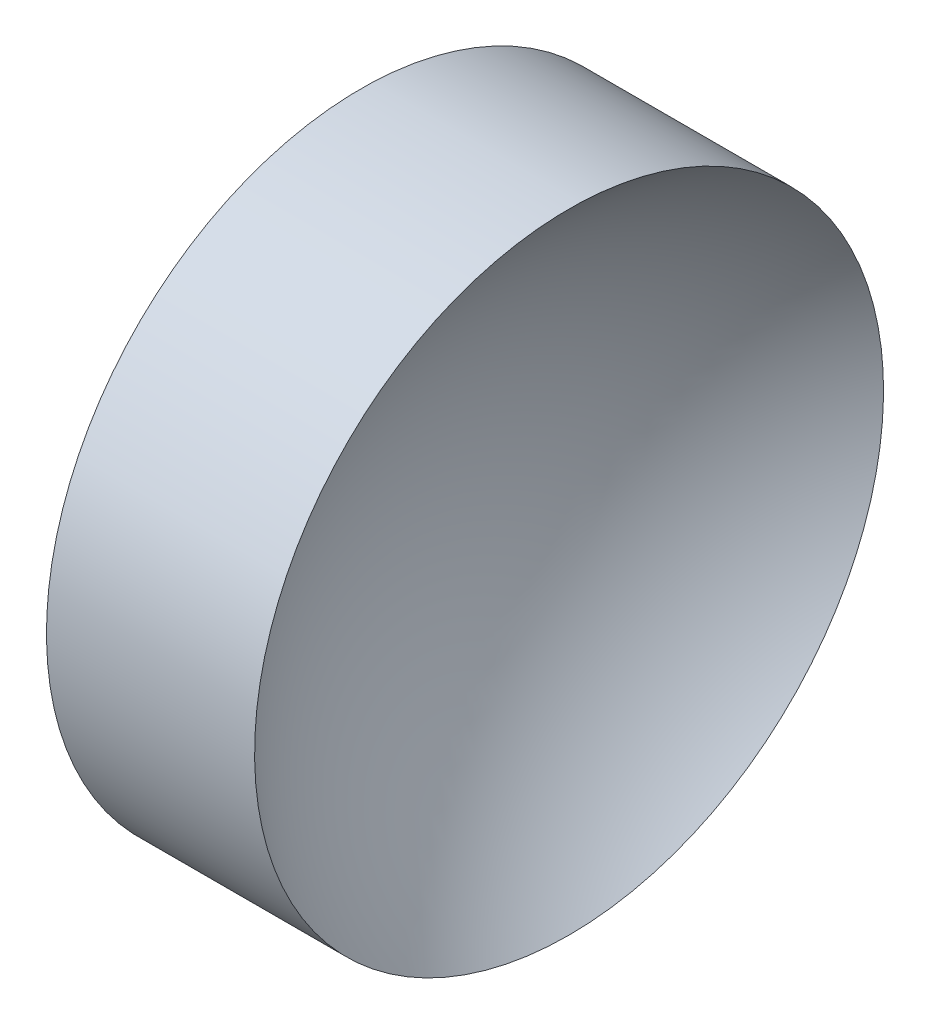
ISO-10303-21;
HEADER;
FILE_DESCRIPTION(('STEP AP214'),'2;1');
FILE_NAME('part.step','',(''),(''),'','','');
FILE_SCHEMA(('AUTOMOTIVE_DESIGN { 1 0 10303 214 1 1 1 1 }'));
ENDSEC;
DATA;
#1=APPLICATION_CONTEXT('core data for automotive mechanical design processes');
#2=APPLICATION_PROTOCOL_DEFINITION('international standard','automotive_design',2000,#1);
#3=PRODUCT_CONTEXT('',#1,'mechanical');
#4=PRODUCT('Part','Part','',(#3));
#5=PRODUCT_RELATED_PRODUCT_CATEGORY('part','',(#4));
#6=PRODUCT_DEFINITION_FORMATION('','',#4);
#7=PRODUCT_DEFINITION_CONTEXT('part definition',#1,'design');
#8=PRODUCT_DEFINITION('design','',#6,#7);
#9=PRODUCT_DEFINITION_SHAPE('','',#8);
#10=(LENGTH_UNIT() NAMED_UNIT(*) SI_UNIT(.MILLI.,.METRE.));
#11=(NAMED_UNIT(*) PLANE_ANGLE_UNIT() SI_UNIT($,.RADIAN.));
#12=(NAMED_UNIT(*) SI_UNIT($,.STERADIAN.) SOLID_ANGLE_UNIT());
#13=UNCERTAINTY_MEASURE_WITH_UNIT(LENGTH_MEASURE(1.E-05),#10,'distance_accuracy_value','');
#14=(GEOMETRIC_REPRESENTATION_CONTEXT(3) GLOBAL_UNCERTAINTY_ASSIGNED_CONTEXT((#13)) GLOBAL_UNIT_ASSIGNED_CONTEXT((#10,
#11,#12)) REPRESENTATION_CONTEXT('',''));
#15=CARTESIAN_POINT('',(0.,0.,0.));
#16=DIRECTION('',(0.,0.,1.));
#17=DIRECTION('',(1.,0.,0.));
#18=AXIS2_PLACEMENT_3D('',#15,#16,#17);
#19=CARTESIAN_POINT('',(56.6844226262245,26.0622521828061,0.));
#20=DIRECTION('',(-1.,0.,0.));
#21=DIRECTION('',(0.,-1.,0.));
#22=AXIS2_PLACEMENT_3D('',#19,#20,#21);
#23=SPHERICAL_SURFACE('',#22,10.33);
#24=CARTESIAN_POINT('',(50.1492179622526,26.0622521828061,0.));
#25=DIRECTION('',(-1.,0.,0.));
#26=DIRECTION('',(0.,-1.,0.));
#27=AXIS2_PLACEMENT_3D('',#24,#25,#26);
#28=CIRCLE('',#27,8.);
#29=CARTESIAN_POINT('',(50.1492179622526,18.0622521828061,0.));
#30=VERTEX_POINT('',#29);
#31=EDGE_CURVE('E10',#30,#30,#28,.T.);
#32=ORIENTED_EDGE('',*,*,#31,.F.);
#33=EDGE_LOOP('',(#32));
#34=FACE_BOUND('',#33,.T.);
#35=ADVANCED_FACE('F35',(#34),#23,.F.);
#36=CARTESIAN_POINT('',(43.0119502361649,26.0622521828061,0.));
#37=DIRECTION('',(-1.,0.,0.));
#38=DIRECTION('',(0.,-1.,0.));
#39=AXIS2_PLACEMENT_3D('',#36,#37,#38);
#40=CYLINDRICAL_SURFACE('',#39,8.);
#41=CARTESIAN_POINT('',(44.8544226262245,26.0622521828061,0.));
#42=DIRECTION('',(-1.,0.,0.));
#43=DIRECTION('',(0.,-1.,0.));
#44=AXIS2_PLACEMENT_3D('',#41,#42,#43);
#45=CIRCLE('',#44,8.);
#46=CARTESIAN_POINT('',(44.8544226262245,18.0622521828061,0.));
#47=VERTEX_POINT('',#46);
#48=EDGE_CURVE('E41',#47,#47,#45,.T.);
#49=ORIENTED_EDGE('',*,*,#48,.F.);
#50=EDGE_LOOP('',(#49));
#51=FACE_BOUND('',#50,.T.);
#52=ORIENTED_EDGE('',*,*,#31,.T.);
#53=EDGE_LOOP('',(#52));
#54=FACE_BOUND('',#53,.T.);
#55=ADVANCED_FACE('F49',(#51,#54),#40,.T.);
#56=CARTESIAN_POINT('',(44.8544226262245,26.0622521828061,0.));
#57=DIRECTION('',(1.,0.,0.));
#58=DIRECTION('',(0.,1.,0.));
#59=AXIS2_PLACEMENT_3D('',#56,#57,#58);
#60=PLANE('',#59);
#61=ORIENTED_EDGE('',*,*,#48,.T.);
#62=EDGE_LOOP('',(#61));
#63=FACE_BOUND('',#62,.T.);
#64=ADVANCED_FACE('F47',(#63),#60,.F.);
#65=CLOSED_SHELL('',(#35,#55,#64));
#66=MANIFOLD_SOLID_BREP('B2',#65);
#67=ADVANCED_BREP_SHAPE_REPRESENTATION('',(#18,#66),#14);
#68=SHAPE_DEFINITION_REPRESENTATION(#9,#67);
ENDSEC;
END-ISO-10303-21;
